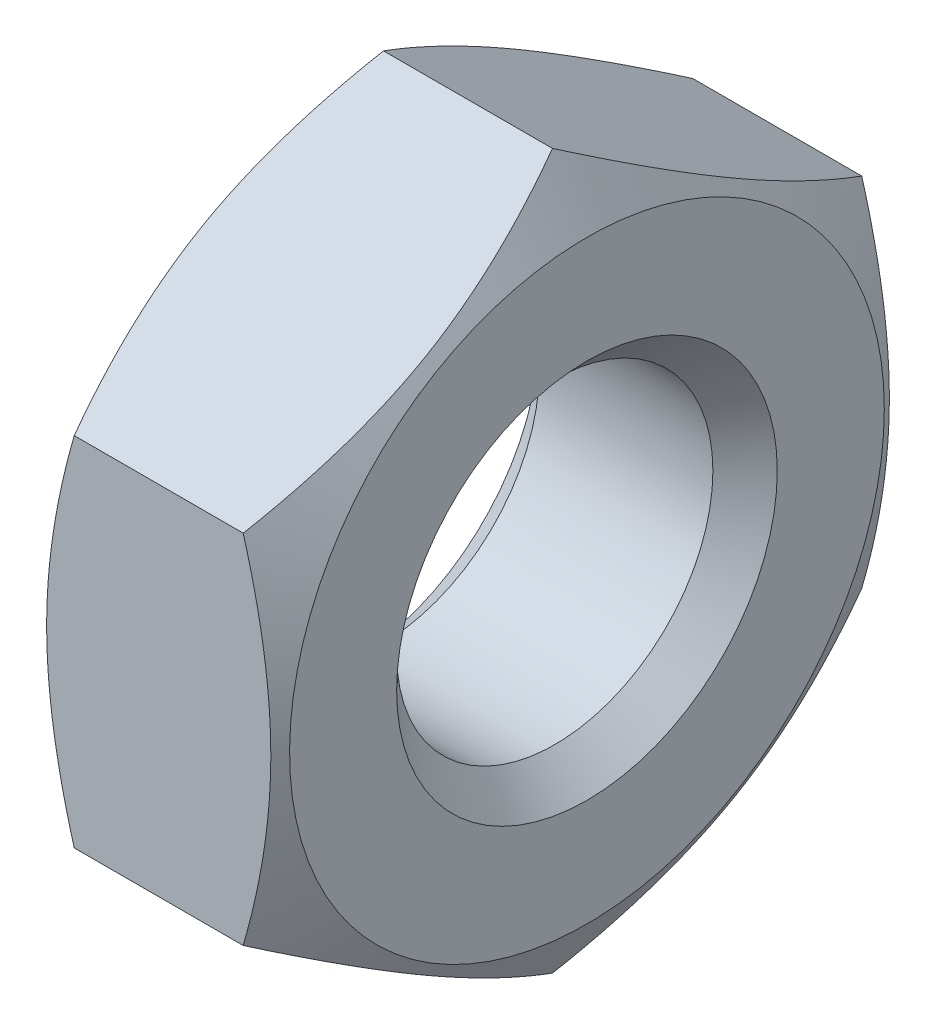
ISO-10303-21;
HEADER;
FILE_DESCRIPTION(('STEP AP214'),'2;1');
FILE_NAME('part.step','',(''),(''),'','','');
FILE_SCHEMA(('AUTOMOTIVE_DESIGN { 1 0 10303 214 1 1 1 1 }'));
ENDSEC;
DATA;
#1=APPLICATION_CONTEXT('core data for automotive mechanical design processes');
#2=APPLICATION_PROTOCOL_DEFINITION('international standard','automotive_design',2000,#1);
#3=PRODUCT_CONTEXT('',#1,'mechanical');
#4=PRODUCT('Part','Part','',(#3));
#5=PRODUCT_RELATED_PRODUCT_CATEGORY('part','',(#4));
#6=PRODUCT_DEFINITION_FORMATION('','',#4);
#7=PRODUCT_DEFINITION_CONTEXT('part definition',#1,'design');
#8=PRODUCT_DEFINITION('design','',#6,#7);
#9=PRODUCT_DEFINITION_SHAPE('','',#8);
#10=(LENGTH_UNIT() NAMED_UNIT(*) SI_UNIT(.MILLI.,.METRE.));
#11=(NAMED_UNIT(*) PLANE_ANGLE_UNIT() SI_UNIT($,.RADIAN.));
#12=(NAMED_UNIT(*) SI_UNIT($,.STERADIAN.) SOLID_ANGLE_UNIT());
#13=UNCERTAINTY_MEASURE_WITH_UNIT(LENGTH_MEASURE(1.E-05),#10,'distance_accuracy_value','');
#14=(GEOMETRIC_REPRESENTATION_CONTEXT(3) GLOBAL_UNCERTAINTY_ASSIGNED_CONTEXT((#13)) GLOBAL_UNIT_ASSIGNED_CONTEXT((#10,
#11,#12)) REPRESENTATION_CONTEXT('',''));
#15=CARTESIAN_POINT('',(0.,0.,0.));
#16=DIRECTION('',(0.,0.,1.));
#17=DIRECTION('',(1.,0.,0.));
#18=AXIS2_PLACEMENT_3D('',#15,#16,#17);
#19=CARTESIAN_POINT('',(2.5,3.75277674973257,6.5));
#20=DIRECTION('',(0.,0.,-1.));
#21=DIRECTION('',(0.,-1.,0.));
#22=AXIS2_PLACEMENT_3D('',#19,#20,#21);
#23=PLANE('',#22);
#24=DIRECTION('',(-1.,0.,0.));
#25=VECTOR('',#24,1.);
#26=CARTESIAN_POINT('',(2.5,3.75277674973257,6.5));
#27=LINE('',#26,#25);
#28=CARTESIAN_POINT('',(1.77510584910183,3.75277674973257,6.5));
#29=VERTEX_POINT('',#28);
#30=CARTESIAN_POINT('',(-1.77510584910183,3.75277674973257,6.5));
#31=VERTEX_POINT('',#30);
#32=EDGE_CURVE('E44',#29,#31,#27,.T.);
#33=ORIENTED_EDGE('',*,*,#32,.T.);
#34=CARTESIAN_POINT('',(-1.77510584910183,3.75277674973257,6.5));
#35=CARTESIAN_POINT('',(-2.35645305603887,1.73893095122614,6.5));
#36=CARTESIAN_POINT('',(-2.35566216961135,-0.00243391382923541,6.5));
#37=CARTESIAN_POINT('',(-2.35487100497458,-1.74441133687317,6.5));
#38=CARTESIAN_POINT('',(-1.77510584910183,-3.75277674973256,6.5));
#39=B_SPLINE_CURVE_WITH_KNOTS('',2,(#34,#35,#36,#37,#38),.UNSPECIFIED.,.F.,.F.,(3,2,3),(0.,0.5,
1.),.UNSPECIFIED.);
#40=CARTESIAN_POINT('',(-1.77510584910183,-3.75277674973257,6.5));
#41=VERTEX_POINT('',#40);
#42=EDGE_CURVE('E121',#31,#41,#39,.T.);
#43=ORIENTED_EDGE('',*,*,#42,.T.);
#44=DIRECTION('',(-1.,0.,0.));
#45=VECTOR('',#44,1.);
#46=CARTESIAN_POINT('',(2.5,-3.75277674973257,6.5));
#47=LINE('',#46,#45);
#48=CARTESIAN_POINT('',(1.77510584910183,-3.75277674973257,6.5));
#49=VERTEX_POINT('',#48);
#50=EDGE_CURVE('E11',#49,#41,#47,.T.);
#51=ORIENTED_EDGE('',*,*,#50,.F.);
#52=CARTESIAN_POINT('',(1.77510584910183,-3.75277674973257,6.5));
#53=CARTESIAN_POINT('',(2.35645305603781,-1.73893095122982,6.5));
#54=CARTESIAN_POINT('',(2.35566216961135,0.00243391382923454,6.5));
#55=CARTESIAN_POINT('',(2.35487100497564,1.74441133686948,6.5));
#56=CARTESIAN_POINT('',(1.77510584910183,3.75277674973257,6.5));
#57=B_SPLINE_CURVE_WITH_KNOTS('',2,(#52,#53,#54,#55,#56),.UNSPECIFIED.,.F.,.F.,(3,2,3),(0.,0.5,
1.),.UNSPECIFIED.);
#58=EDGE_CURVE('E117',#49,#29,#57,.T.);
#59=ORIENTED_EDGE('',*,*,#58,.T.);
#60=EDGE_LOOP('',(#33,#43,#51,#59));
#61=FACE_BOUND('',#60,.T.);
#62=ADVANCED_FACE('F16',(#61),#23,.F.);
#63=CARTESIAN_POINT('',(2.5,-3.75277674973257,6.5));
#64=DIRECTION('',(0.,0.866025403784439,-0.5));
#65=DIRECTION('',(-1.,0.,0.));
#66=AXIS2_PLACEMENT_3D('',#63,#64,#65);
#67=PLANE('',#66);
#68=ORIENTED_EDGE('',*,*,#50,.T.);
#69=CARTESIAN_POINT('',(-1.77510584910236,-3.75277674973253,6.50000000000007));
#70=CARTESIAN_POINT('',(-2.35539997851723,-4.75787566521302,4.75911761175548));
#71=CARTESIAN_POINT('',(-2.3556601495155,-5.62558009445715,3.25620945435209));
#72=CARTESIAN_POINT('',(-2.35592219916474,-6.49955007128996,1.74244905018787));
#73=CARTESIAN_POINT('',(-1.7751058491021,-7.50555349946516,0.));
#74=B_SPLINE_CURVE_WITH_KNOTS('',2,(#69,#70,#71,#72,#73),.UNSPECIFIED.,.F.,.F.,(3,2,3),(0.,0.5,
1.),.UNSPECIFIED.);
#75=CARTESIAN_POINT('',(-1.77510584910183,-7.50555349946513,0.));
#76=VERTEX_POINT('',#75);
#77=EDGE_CURVE('E378',#41,#76,#74,.T.);
#78=ORIENTED_EDGE('',*,*,#77,.T.);
#79=DIRECTION('',(-1.,0.,0.));
#80=VECTOR('',#79,1.);
#81=CARTESIAN_POINT('',(2.5,-7.50555349946513,0.));
#82=LINE('',#81,#80);
#83=CARTESIAN_POINT('',(1.77510584910183,-7.50555349946513,0.));
#84=VERTEX_POINT('',#83);
#85=EDGE_CURVE('E30',#84,#76,#82,.T.);
#86=ORIENTED_EDGE('',*,*,#85,.F.);
#87=CARTESIAN_POINT('',(1.77510584910236,-7.50555349946517,0.));
#88=CARTESIAN_POINT('',(2.35539997851951,-6.50045458398076,1.74088238825133));
#89=CARTESIAN_POINT('',(2.3556601495155,-5.63275015474055,3.24379054564791));
#90=CARTESIAN_POINT('',(2.35592219916245,-4.75878017790378,4.757550949819));
#91=CARTESIAN_POINT('',(1.7751058491021,-3.75277674973254,6.50000000000004));
#92=B_SPLINE_CURVE_WITH_KNOTS('',2,(#87,#88,#89,#90,#91),.UNSPECIFIED.,.F.,.F.,(3,2,3),(0.,0.5,
1.),.UNSPECIFIED.);
#93=EDGE_CURVE('E133',#84,#49,#92,.T.);
#94=ORIENTED_EDGE('',*,*,#93,.T.);
#95=EDGE_LOOP('',(#68,#78,#86,#94));
#96=FACE_BOUND('',#95,.T.);
#97=ADVANCED_FACE('F18',(#96),#67,.F.);
#98=CARTESIAN_POINT('',(2.5,-7.50555349946513,0.));
#99=DIRECTION('',(0.,0.866025403784439,0.5));
#100=DIRECTION('',(1.,0.,0.));
#101=AXIS2_PLACEMENT_3D('',#98,#99,#100);
#102=PLANE('',#101);
#103=ORIENTED_EDGE('',*,*,#85,.T.);
#104=CARTESIAN_POINT('',(-1.77510584910236,-7.50555349946517,0.));
#105=CARTESIAN_POINT('',(-2.35539997851951,-6.50045458398075,-1.74088238825133));
#106=CARTESIAN_POINT('',(-2.3556601495155,-5.63275015474054,-3.24379054564791));
#107=CARTESIAN_POINT('',(-2.35592219916245,-4.75878017790376,-4.75755094981901));
#108=CARTESIAN_POINT('',(-1.7751058491021,-3.75277674973254,-6.50000000000004));
#109=B_SPLINE_CURVE_WITH_KNOTS('',2,(#104,#105,#106,#107,#108),.UNSPECIFIED.,.F.,.F.,(3,2,3),
(0.,0.5,1.),.UNSPECIFIED.);
#110=CARTESIAN_POINT('',(-1.77510584910183,-3.75277674973257,-6.5));
#111=VERTEX_POINT('',#110);
#112=EDGE_CURVE('E258',#76,#111,#109,.T.);
#113=ORIENTED_EDGE('',*,*,#112,.T.);
#114=DIRECTION('',(-1.,0.,0.));
#115=VECTOR('',#114,1.);
#116=CARTESIAN_POINT('',(2.5,-3.75277674973257,-6.5));
#117=LINE('',#116,#115);
#118=CARTESIAN_POINT('',(1.77510584910207,-3.75277674973298,-6.5));
#119=VERTEX_POINT('',#118);
#120=EDGE_CURVE('E206',#119,#111,#117,.T.);
#121=ORIENTED_EDGE('',*,*,#120,.F.);
#122=CARTESIAN_POINT('',(1.77510584910243,-3.75277674973264,-6.49999999999987));
#123=CARTESIAN_POINT('',(2.35539997851894,-4.75787566521602,-4.75911761175028));
#124=CARTESIAN_POINT('',(2.3556601495155,-5.62558009445721,-3.25620945435199));
#125=CARTESIAN_POINT('',(2.35592219916302,-6.49955007129293,-1.74244905018271));
#126=CARTESIAN_POINT('',(1.7751058491021,-7.50555349946515,0.));
#127=B_SPLINE_CURVE_WITH_KNOTS('',2,(#122,#123,#124,#125,#126),.UNSPECIFIED.,.F.,.F.,(3,2,3),
(0.,0.5,1.),.UNSPECIFIED.);
#128=EDGE_CURVE('E146',#119,#84,#127,.T.);
#129=ORIENTED_EDGE('',*,*,#128,.T.);
#130=EDGE_LOOP('',(#103,#113,#121,#129));
#131=FACE_BOUND('',#130,.T.);
#132=ADVANCED_FACE('F226',(#131),#102,.F.);
#133=CARTESIAN_POINT('',(2.5,-3.75277674973257,-6.5));
#134=DIRECTION('',(0.,0.,1.));
#135=DIRECTION('',(1.,0.,0.));
#136=AXIS2_PLACEMENT_3D('',#133,#134,#135);
#137=PLANE('',#136);
#138=ORIENTED_EDGE('',*,*,#120,.T.);
#139=CARTESIAN_POINT('',(-1.77510584910183,-3.75277674973257,-6.5));
#140=CARTESIAN_POINT('',(-2.35645305603887,-1.73893095122614,-6.5));
#141=CARTESIAN_POINT('',(-2.35566216961135,0.00243391382923541,-6.5));
#142=CARTESIAN_POINT('',(-2.35487100497458,1.74441133687317,-6.5));
#143=CARTESIAN_POINT('',(-1.77510584910183,3.75277674973256,-6.5));
#144=B_SPLINE_CURVE_WITH_KNOTS('',2,(#139,#140,#141,#142,#143),.UNSPECIFIED.,.F.,.F.,(3,2,3),
(0.,0.5,1.),.UNSPECIFIED.);
#145=CARTESIAN_POINT('',(-1.77510584910183,3.75277674973257,-6.5));
#146=VERTEX_POINT('',#145);
#147=EDGE_CURVE('E389',#111,#146,#144,.T.);
#148=ORIENTED_EDGE('',*,*,#147,.T.);
#149=DIRECTION('',(-1.,0.,0.));
#150=VECTOR('',#149,1.);
#151=CARTESIAN_POINT('',(2.5,3.75277674973257,-6.5));
#152=LINE('',#151,#150);
#153=CARTESIAN_POINT('',(1.77510584910183,3.75277674973257,-6.5));
#154=VERTEX_POINT('',#153);
#155=EDGE_CURVE('E213',#154,#146,#152,.T.);
#156=ORIENTED_EDGE('',*,*,#155,.F.);
#157=CARTESIAN_POINT('',(1.77510584910183,3.75277674973257,-6.5));
#158=CARTESIAN_POINT('',(2.35645305603781,1.73893095122983,-6.5));
#159=CARTESIAN_POINT('',(2.35566216961135,-0.00243391382941452,-6.5));
#160=CARTESIAN_POINT('',(2.35487100497564,-1.74441133686962,-6.5));
#161=CARTESIAN_POINT('',(1.77510584910173,-3.75277674973291,-6.5));
#162=B_SPLINE_CURVE_WITH_KNOTS('',2,(#157,#158,#159,#160,#161),.UNSPECIFIED.,.F.,.F.,(3,2,3),
(0.,0.5,1.),.UNSPECIFIED.);
#163=EDGE_CURVE('E355',#154,#119,#162,.T.);
#164=ORIENTED_EDGE('',*,*,#163,.T.);
#165=EDGE_LOOP('',(#138,#148,#156,#164));
#166=FACE_BOUND('',#165,.T.);
#167=ADVANCED_FACE('F236',(#166),#137,.F.);
#168=CARTESIAN_POINT('',(2.5,3.75277674973257,-6.5));
#169=DIRECTION('',(0.,-0.866025403784439,0.5));
#170=DIRECTION('',(-1.,0.,0.));
#171=AXIS2_PLACEMENT_3D('',#168,#169,#170);
#172=PLANE('',#171);
#173=ORIENTED_EDGE('',*,*,#155,.T.);
#174=CARTESIAN_POINT('',(-1.77510584910236,3.75277674973253,-6.50000000000007));
#175=CARTESIAN_POINT('',(-2.35539997851723,4.75787566521302,-4.75911761175548));
#176=CARTESIAN_POINT('',(-2.3556601495155,5.62558009445715,-3.25620945435209));
#177=CARTESIAN_POINT('',(-2.35592219916474,6.49955007128996,-1.74244905018787));
#178=CARTESIAN_POINT('',(-1.7751058491021,7.50555349946516,0.));
#179=B_SPLINE_CURVE_WITH_KNOTS('',2,(#174,#175,#176,#177,#178),.UNSPECIFIED.,.F.,.F.,(3,2,3),
(0.,0.5,1.),.UNSPECIFIED.);
#180=CARTESIAN_POINT('',(-1.77510584910183,7.50555349946513,0.));
#181=VERTEX_POINT('',#180);
#182=EDGE_CURVE('E395',#146,#181,#179,.T.);
#183=ORIENTED_EDGE('',*,*,#182,.T.);
#184=DIRECTION('',(-1.,0.,0.));
#185=VECTOR('',#184,1.);
#186=CARTESIAN_POINT('',(2.5,7.50555349946513,0.));
#187=LINE('',#186,#185);
#188=CARTESIAN_POINT('',(1.77510584910183,7.50555349946513,0.));
#189=VERTEX_POINT('',#188);
#190=EDGE_CURVE('E139',#189,#181,#187,.T.);
#191=ORIENTED_EDGE('',*,*,#190,.F.);
#192=CARTESIAN_POINT('',(1.77510584910236,7.50555349946517,0.));
#193=CARTESIAN_POINT('',(2.35539997851951,6.50045458398076,-1.74088238825133));
#194=CARTESIAN_POINT('',(2.3556601495155,5.63275015474055,-3.24379054564791));
#195=CARTESIAN_POINT('',(2.35592219916245,4.75878017790378,-4.757550949819));
#196=CARTESIAN_POINT('',(1.7751058491021,3.75277674973254,-6.50000000000004));
#197=B_SPLINE_CURVE_WITH_KNOTS('',2,(#192,#193,#194,#195,#196),.UNSPECIFIED.,.F.,.F.,(3,2,3),
(0.,0.5,1.),.UNSPECIFIED.);
#198=EDGE_CURVE('E346',#189,#154,#197,.T.);
#199=ORIENTED_EDGE('',*,*,#198,.T.);
#200=EDGE_LOOP('',(#173,#183,#191,#199));
#201=FACE_BOUND('',#200,.T.);
#202=ADVANCED_FACE('F239',(#201),#172,.F.);
#203=CARTESIAN_POINT('',(2.5,7.50555349946513,0.));
#204=DIRECTION('',(0.,-0.866025403784439,-0.5));
#205=DIRECTION('',(0.,0.5,-0.866025403784439));
#206=AXIS2_PLACEMENT_3D('',#203,#204,#205);
#207=PLANE('',#206);
#208=ORIENTED_EDGE('',*,*,#190,.T.);
#209=CARTESIAN_POINT('',(-1.77510584910236,7.50555349946517,0.));
#210=CARTESIAN_POINT('',(-2.35539997851723,6.50045458398468,1.74088238824451));
#211=CARTESIAN_POINT('',(-2.3556601495155,5.63275015474054,3.24379054564791));
#212=CARTESIAN_POINT('',(-2.35592219916474,4.75878017790773,4.75755094981214));
#213=CARTESIAN_POINT('',(-1.7751058491021,3.75277674973254,6.50000000000004));
#214=B_SPLINE_CURVE_WITH_KNOTS('',2,(#209,#210,#211,#212,#213),.UNSPECIFIED.,.F.,.F.,(3,2,3),
(0.,0.5,1.),.UNSPECIFIED.);
#215=EDGE_CURVE('E303',#181,#31,#214,.T.);
#216=ORIENTED_EDGE('',*,*,#215,.T.);
#217=ORIENTED_EDGE('',*,*,#32,.F.);
#218=CARTESIAN_POINT('',(1.77510584910236,3.75277674973252,6.50000000000007));
#219=CARTESIAN_POINT('',(2.35539997851951,4.75787566521695,4.75911761174867));
#220=CARTESIAN_POINT('',(2.3556601495155,5.62558009445715,3.25620945435209));
#221=CARTESIAN_POINT('',(2.35592219916245,6.49955007129392,1.742449050181));
#222=CARTESIAN_POINT('',(1.7751058491021,7.50555349946515,0.));
#223=B_SPLINE_CURVE_WITH_KNOTS('',2,(#218,#219,#220,#221,#222),.UNSPECIFIED.,.F.,.F.,(3,2,3),
(0.,0.5,1.),.UNSPECIFIED.);
#224=EDGE_CURVE('E136',#29,#189,#223,.T.);
#225=ORIENTED_EDGE('',*,*,#224,.T.);
#226=EDGE_LOOP('',(#208,#216,#217,#225));
#227=FACE_BOUND('',#226,.T.);
#228=ADVANCED_FACE('F171',(#227),#207,.F.);
#229=CARTESIAN_POINT('',(0.,0.,0.));
#230=DIRECTION('',(-1.,0.,0.));
#231=DIRECTION('',(0.,0.,1.));
#232=AXIS2_PLACEMENT_3D('',#229,#230,#231);
#233=CONICAL_SURFACE('',#232,10.5801270189222,1.0471975511966);
#234=ORIENTED_EDGE('',*,*,#93,.F.);
#235=ORIENTED_EDGE('',*,*,#128,.F.);
#236=ORIENTED_EDGE('',*,*,#163,.F.);
#237=ORIENTED_EDGE('',*,*,#198,.F.);
#238=ORIENTED_EDGE('',*,*,#224,.F.);
#239=ORIENTED_EDGE('',*,*,#58,.F.);
#240=EDGE_LOOP('',(#234,#235,#236,#237,#238,#239));
#241=FACE_BOUND('',#240,.T.);
#242=CARTESIAN_POINT('',(2.5,0.,0.));
#243=DIRECTION('',(1.,0.,0.));
#244=DIRECTION('',(0.,0.,-1.));
#245=AXIS2_PLACEMENT_3D('',#242,#243,#244);
#246=CIRCLE('',#245,6.25);
#247=CARTESIAN_POINT('',(2.5,0.,-6.25));
#248=VERTEX_POINT('',#247);
#249=EDGE_CURVE('E424',#248,#248,#246,.T.);
#250=ORIENTED_EDGE('',*,*,#249,.F.);
#251=EDGE_LOOP('',(#250));
#252=FACE_BOUND('',#251,.T.);
#253=ADVANCED_FACE('F130',(#241,#252),#233,.T.);
#254=CARTESIAN_POINT('',(-2.5,0.,0.));
#255=DIRECTION('',(1.,0.,0.));
#256=DIRECTION('',(0.,0.,-1.));
#257=AXIS2_PLACEMENT_3D('',#254,#255,#256);
#258=CONICAL_SURFACE('',#257,6.25,1.0471975511966);
#259=CARTESIAN_POINT('',(-2.5,0.,0.));
#260=DIRECTION('',(1.,0.,0.));
#261=DIRECTION('',(0.,0.,-1.));
#262=AXIS2_PLACEMENT_3D('',#259,#260,#261);
#263=CIRCLE('',#262,6.25);
#264=CARTESIAN_POINT('',(-2.5,0.,-6.25));
#265=VERTEX_POINT('',#264);
#266=EDGE_CURVE('E92',#265,#265,#263,.T.);
#267=ORIENTED_EDGE('',*,*,#266,.T.);
#268=EDGE_LOOP('',(#267));
#269=FACE_BOUND('',#268,.T.);
#270=ORIENTED_EDGE('',*,*,#215,.F.);
#271=ORIENTED_EDGE('',*,*,#182,.F.);
#272=ORIENTED_EDGE('',*,*,#147,.F.);
#273=ORIENTED_EDGE('',*,*,#112,.F.);
#274=ORIENTED_EDGE('',*,*,#77,.F.);
#275=ORIENTED_EDGE('',*,*,#42,.F.);
#276=EDGE_LOOP('',(#270,#271,#272,#273,#274,#275));
#277=FACE_BOUND('',#276,.T.);
#278=ADVANCED_FACE('F170',(#269,#277),#258,.T.);
#279=CARTESIAN_POINT('',(1.8235,0.,0.));
#280=DIRECTION('',(1.,0.,0.));
#281=DIRECTION('',(0.,0.,-1.));
#282=AXIS2_PLACEMENT_3D('',#279,#280,#281);
#283=CONICAL_SURFACE('',#282,3.3235,0.785398163397449);
#284=CARTESIAN_POINT('',(1.8235,0.,0.));
#285=DIRECTION('',(1.,0.,0.));
#286=DIRECTION('',(0.,0.,-1.));
#287=AXIS2_PLACEMENT_3D('',#284,#285,#286);
#288=CIRCLE('',#287,3.3235);
#289=CARTESIAN_POINT('',(1.8235,0.,-3.3235));
#290=VERTEX_POINT('',#289);
#291=EDGE_CURVE('E404',#290,#290,#288,.T.);
#292=ORIENTED_EDGE('',*,*,#291,.F.);
#293=EDGE_LOOP('',(#292));
#294=FACE_BOUND('',#293,.T.);
#295=CARTESIAN_POINT('',(2.5,0.,0.));
#296=DIRECTION('',(1.,0.,0.));
#297=DIRECTION('',(0.,0.,-1.));
#298=AXIS2_PLACEMENT_3D('',#295,#296,#297);
#299=CIRCLE('',#298,4.);
#300=CARTESIAN_POINT('',(2.5,0.,-4.));
#301=VERTEX_POINT('',#300);
#302=EDGE_CURVE('E430',#301,#301,#299,.T.);
#303=ORIENTED_EDGE('',*,*,#302,.T.);
#304=EDGE_LOOP('',(#303));
#305=FACE_BOUND('',#304,.T.);
#306=ADVANCED_FACE('F172',(#294,#305),#283,.F.);
#307=CARTESIAN_POINT('',(2.5,0.,0.));
#308=DIRECTION('',(1.,0.,0.));
#309=DIRECTION('',(0.,0.,-1.));
#310=AXIS2_PLACEMENT_3D('',#307,#308,#309);
#311=CYLINDRICAL_SURFACE('',#310,3.3235);
#312=CARTESIAN_POINT('',(-1.8235,0.,0.));
#313=DIRECTION('',(1.,0.,0.));
#314=DIRECTION('',(0.,0.,-1.));
#315=AXIS2_PLACEMENT_3D('',#312,#313,#314);
#316=CIRCLE('',#315,3.3235);
#317=CARTESIAN_POINT('',(-1.8235,0.,-3.3235));
#318=VERTEX_POINT('',#317);
#319=EDGE_CURVE('E410',#318,#318,#316,.T.);
#320=ORIENTED_EDGE('',*,*,#319,.F.);
#321=EDGE_LOOP('',(#320));
#322=FACE_BOUND('',#321,.T.);
#323=ORIENTED_EDGE('',*,*,#291,.T.);
#324=EDGE_LOOP('',(#323));
#325=FACE_BOUND('',#324,.T.);
#326=ADVANCED_FACE('F315',(#322,#325),#311,.F.);
#327=CARTESIAN_POINT('',(-2.5,0.,0.));
#328=DIRECTION('',(-1.,0.,0.));
#329=DIRECTION('',(0.,0.,1.));
#330=AXIS2_PLACEMENT_3D('',#327,#328,#329);
#331=CONICAL_SURFACE('',#330,4.,0.785398163397448);
#332=CARTESIAN_POINT('',(-2.5,0.,0.));
#333=DIRECTION('',(1.,0.,0.));
#334=DIRECTION('',(0.,0.,-1.));
#335=AXIS2_PLACEMENT_3D('',#332,#333,#334);
#336=CIRCLE('',#335,4.);
#337=CARTESIAN_POINT('',(-2.5,0.,-4.));
#338=VERTEX_POINT('',#337);
#339=EDGE_CURVE('E81',#338,#338,#336,.T.);
#340=ORIENTED_EDGE('',*,*,#339,.F.);
#341=EDGE_LOOP('',(#340));
#342=FACE_BOUND('',#341,.T.);
#343=ORIENTED_EDGE('',*,*,#319,.T.);
#344=EDGE_LOOP('',(#343));
#345=FACE_BOUND('',#344,.T.);
#346=ADVANCED_FACE('F455',(#342,#345),#331,.F.);
#347=CARTESIAN_POINT('',(-2.5,0.,0.));
#348=DIRECTION('',(1.,0.,0.));
#349=DIRECTION('',(0.,1.,0.));
#350=AXIS2_PLACEMENT_3D('',#347,#348,#349);
#351=PLANE('',#350);
#352=ORIENTED_EDGE('',*,*,#339,.T.);
#353=EDGE_LOOP('',(#352));
#354=FACE_BOUND('',#353,.T.);
#355=ORIENTED_EDGE('',*,*,#266,.F.);
#356=EDGE_LOOP('',(#355));
#357=FACE_BOUND('',#356,.T.);
#358=ADVANCED_FACE('F270',(#354,#357),#351,.F.);
#359=CARTESIAN_POINT('',(2.5,0.,0.));
#360=DIRECTION('',(1.,0.,0.));
#361=DIRECTION('',(0.,1.,0.));
#362=AXIS2_PLACEMENT_3D('',#359,#360,#361);
#363=PLANE('',#362);
#364=ORIENTED_EDGE('',*,*,#249,.T.);
#365=EDGE_LOOP('',(#364));
#366=FACE_BOUND('',#365,.T.);
#367=ORIENTED_EDGE('',*,*,#302,.F.);
#368=EDGE_LOOP('',(#367));
#369=FACE_BOUND('',#368,.T.);
#370=ADVANCED_FACE('F237',(#366,#369),#363,.T.);
#371=CLOSED_SHELL('',(#62,#97,#132,#167,#202,#228,#253,#278,#306,#326,#346,#358,#370));
#372=MANIFOLD_SOLID_BREP('B1',#371);
#373=ADVANCED_BREP_SHAPE_REPRESENTATION('',(#18,#372),#14);
#374=SHAPE_DEFINITION_REPRESENTATION(#9,#373);
ENDSEC;
END-ISO-10303-21;
